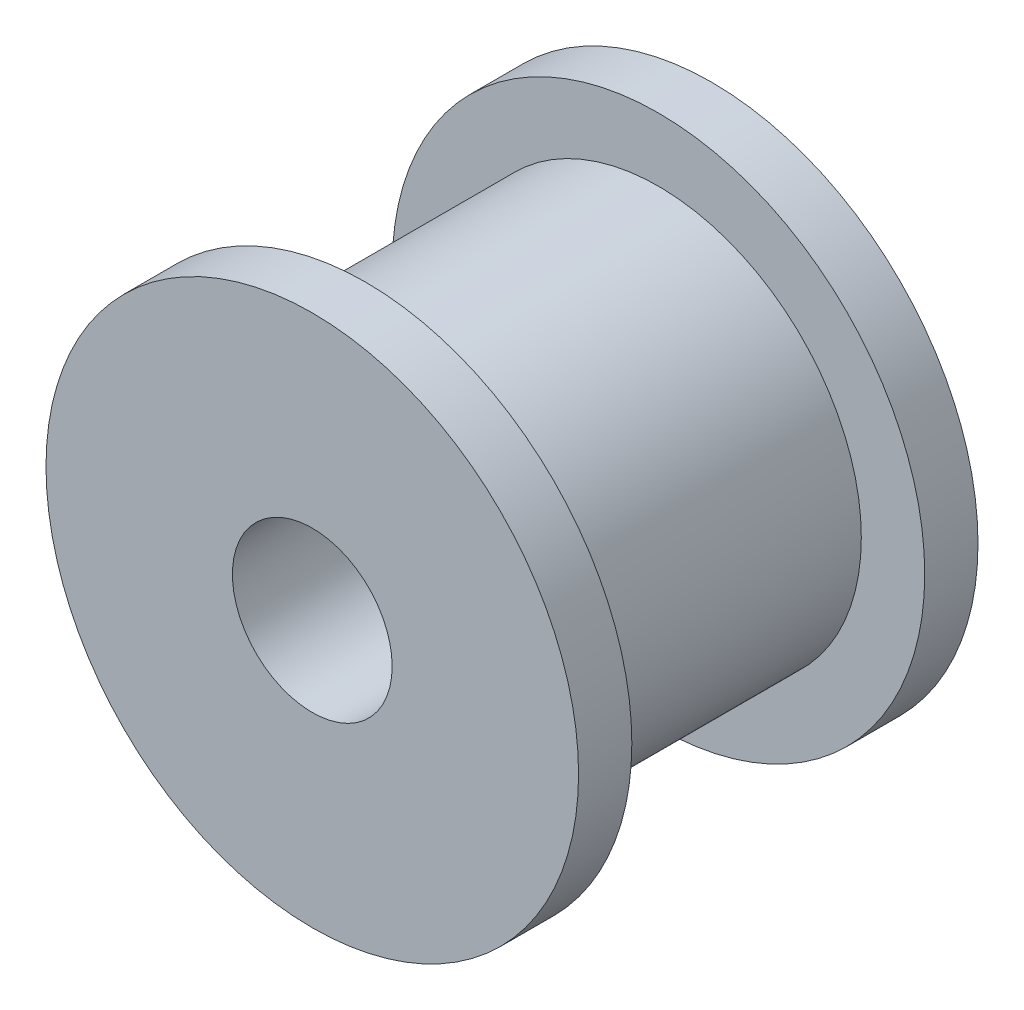
ISO-10303-21;
HEADER;
FILE_DESCRIPTION(('STEP AP214'),'2;1');
FILE_NAME('part.step','',(''),(''),'','','');
FILE_SCHEMA(('AUTOMOTIVE_DESIGN { 1 0 10303 214 1 1 1 1 }'));
ENDSEC;
DATA;
#1=APPLICATION_CONTEXT('core data for automotive mechanical design processes');
#2=APPLICATION_PROTOCOL_DEFINITION('international standard','automotive_design',2000,#1);
#3=PRODUCT_CONTEXT('',#1,'mechanical');
#4=PRODUCT('Part','Part','',(#3));
#5=PRODUCT_RELATED_PRODUCT_CATEGORY('part','',(#4));
#6=PRODUCT_DEFINITION_FORMATION('','',#4);
#7=PRODUCT_DEFINITION_CONTEXT('part definition',#1,'design');
#8=PRODUCT_DEFINITION('design','',#6,#7);
#9=PRODUCT_DEFINITION_SHAPE('','',#8);
#10=(LENGTH_UNIT() NAMED_UNIT(*) SI_UNIT(.MILLI.,.METRE.));
#11=(NAMED_UNIT(*) PLANE_ANGLE_UNIT() SI_UNIT($,.RADIAN.));
#12=(NAMED_UNIT(*) SI_UNIT($,.STERADIAN.) SOLID_ANGLE_UNIT());
#13=UNCERTAINTY_MEASURE_WITH_UNIT(LENGTH_MEASURE(1.E-05),#10,'distance_accuracy_value','');
#14=(GEOMETRIC_REPRESENTATION_CONTEXT(3) GLOBAL_UNCERTAINTY_ASSIGNED_CONTEXT((#13)) GLOBAL_UNIT_ASSIGNED_CONTEXT((#10,
#11,#12)) REPRESENTATION_CONTEXT('',''));
#15=CARTESIAN_POINT('',(0.,0.,0.));
#16=DIRECTION('',(0.,0.,1.));
#17=DIRECTION('',(1.,0.,0.));
#18=AXIS2_PLACEMENT_3D('',#15,#16,#17);
#19=CARTESIAN_POINT('',(0.,0.,15.));
#20=DIRECTION('',(0.,0.,-1.));
#21=DIRECTION('',(-1.,0.,0.));
#22=AXIS2_PLACEMENT_3D('',#19,#20,#21);
#23=CYLINDRICAL_SURFACE('',#22,10.);
#24=CARTESIAN_POINT('',(0.,0.,0.));
#25=DIRECTION('',(0.,0.,1.));
#26=DIRECTION('',(1.,0.,0.));
#27=AXIS2_PLACEMENT_3D('',#24,#25,#26);
#28=CIRCLE('',#27,10.);
#29=CARTESIAN_POINT('',(10.,0.,0.));
#30=VERTEX_POINT('',#29);
#31=EDGE_CURVE('E48',#30,#30,#28,.T.);
#32=ORIENTED_EDGE('',*,*,#31,.T.);
#33=EDGE_LOOP('',(#32));
#34=FACE_BOUND('',#33,.T.);
#35=CARTESIAN_POINT('',(0.,0.,2.));
#36=DIRECTION('',(0.,0.,1.));
#37=DIRECTION('',(1.,0.,0.));
#38=AXIS2_PLACEMENT_3D('',#35,#36,#37);
#39=CIRCLE('',#38,10.);
#40=CARTESIAN_POINT('',(10.,0.,2.));
#41=VERTEX_POINT('',#40);
#42=EDGE_CURVE('E59',#41,#41,#39,.T.);
#43=ORIENTED_EDGE('',*,*,#42,.F.);
#44=EDGE_LOOP('',(#43));
#45=FACE_BOUND('',#44,.T.);
#46=ADVANCED_FACE('F39',(#34,#45),#23,.T.);
#47=CARTESIAN_POINT('',(0.,0.,15.));
#48=DIRECTION('',(0.,0.,1.));
#49=DIRECTION('',(1.,0.,0.));
#50=AXIS2_PLACEMENT_3D('',#47,#48,#49);
#51=PLANE('',#50);
#52=CARTESIAN_POINT('',(0.,0.,15.));
#53=DIRECTION('',(0.,0.,1.));
#54=DIRECTION('',(1.,0.,0.));
#55=AXIS2_PLACEMENT_3D('',#52,#53,#54);
#56=CIRCLE('',#55,10.);
#57=CARTESIAN_POINT('',(10.,0.,15.));
#58=VERTEX_POINT('',#57);
#59=EDGE_CURVE('E11',#58,#58,#56,.T.);
#60=ORIENTED_EDGE('',*,*,#59,.T.);
#61=EDGE_LOOP('',(#60));
#62=FACE_BOUND('',#61,.T.);
#63=CARTESIAN_POINT('',(0.,0.,15.));
#64=DIRECTION('',(0.,0.,1.));
#65=DIRECTION('',(1.,0.,0.));
#66=AXIS2_PLACEMENT_3D('',#63,#64,#65);
#67=CIRCLE('',#66,3.);
#68=CARTESIAN_POINT('',(3.,0.,15.));
#69=VERTEX_POINT('',#68);
#70=EDGE_CURVE('E54',#69,#69,#67,.T.);
#71=ORIENTED_EDGE('',*,*,#70,.F.);
#72=EDGE_LOOP('',(#71));
#73=FACE_BOUND('',#72,.T.);
#74=ADVANCED_FACE('F100',(#62,#73),#51,.T.);
#75=CARTESIAN_POINT('',(0.,0.,0.));
#76=DIRECTION('',(0.,0.,1.));
#77=DIRECTION('',(1.,0.,0.));
#78=AXIS2_PLACEMENT_3D('',#75,#76,#77);
#79=PLANE('',#78);
#80=ORIENTED_EDGE('',*,*,#31,.F.);
#81=EDGE_LOOP('',(#80));
#82=FACE_BOUND('',#81,.T.);
#83=CARTESIAN_POINT('',(0.,0.,0.));
#84=DIRECTION('',(0.,0.,1.));
#85=DIRECTION('',(1.,0.,0.));
#86=AXIS2_PLACEMENT_3D('',#83,#84,#85);
#87=CIRCLE('',#86,3.);
#88=CARTESIAN_POINT('',(3.,0.,0.));
#89=VERTEX_POINT('',#88);
#90=EDGE_CURVE('E57',#89,#89,#87,.T.);
#91=ORIENTED_EDGE('',*,*,#90,.T.);
#92=EDGE_LOOP('',(#91));
#93=FACE_BOUND('',#92,.T.);
#94=ADVANCED_FACE('F84',(#82,#93),#79,.F.);
#95=CARTESIAN_POINT('',(0.,0.,13.));
#96=DIRECTION('',(0.,0.,1.));
#97=DIRECTION('',(1.,0.,0.));
#98=AXIS2_PLACEMENT_3D('',#95,#96,#97);
#99=CIRCLE('',#98,10.);
#100=CARTESIAN_POINT('',(10.,0.,13.));
#101=VERTEX_POINT('',#100);
#102=EDGE_CURVE('E43',#101,#101,#99,.T.);
#103=ORIENTED_EDGE('',*,*,#102,.T.);
#104=EDGE_LOOP('',(#103));
#105=FACE_BOUND('',#104,.T.);
#106=ORIENTED_EDGE('',*,*,#59,.F.);
#107=EDGE_LOOP('',(#106));
#108=FACE_BOUND('',#107,.T.);
#109=ADVANCED_FACE('F41',(#105,#108),#23,.T.);
#110=CARTESIAN_POINT('',(0.,0.,15.));
#111=DIRECTION('',(0.,0.,-1.));
#112=DIRECTION('',(-1.,0.,0.));
#113=AXIS2_PLACEMENT_3D('',#110,#111,#112);
#114=CYLINDRICAL_SURFACE('',#113,3.);
#115=ORIENTED_EDGE('',*,*,#70,.T.);
#116=EDGE_LOOP('',(#115));
#117=FACE_BOUND('',#116,.T.);
#118=ORIENTED_EDGE('',*,*,#90,.F.);
#119=EDGE_LOOP('',(#118));
#120=FACE_BOUND('',#119,.T.);
#121=ADVANCED_FACE('F86',(#117,#120),#114,.F.);
#122=CARTESIAN_POINT('',(0.,0.,13.));
#123=DIRECTION('',(0.,0.,1.));
#124=DIRECTION('',(1.,0.,0.));
#125=AXIS2_PLACEMENT_3D('',#122,#123,#124);
#126=PLANE('',#125);
#127=CARTESIAN_POINT('',(0.,0.,13.));
#128=DIRECTION('',(0.,0.,1.));
#129=DIRECTION('',(1.,0.,0.));
#130=AXIS2_PLACEMENT_3D('',#127,#128,#129);
#131=CIRCLE('',#130,7.61841917315148);
#132=CARTESIAN_POINT('',(7.61841917315148,0.,13.));
#133=VERTEX_POINT('',#132);
#134=EDGE_CURVE('E69',#133,#133,#131,.T.);
#135=ORIENTED_EDGE('',*,*,#134,.T.);
#136=EDGE_LOOP('',(#135));
#137=FACE_BOUND('',#136,.T.);
#138=ORIENTED_EDGE('',*,*,#102,.F.);
#139=EDGE_LOOP('',(#138));
#140=FACE_BOUND('',#139,.T.);
#141=ADVANCED_FACE('F88',(#137,#140),#126,.F.);
#142=CARTESIAN_POINT('',(0.,0.,2.));
#143=DIRECTION('',(0.,0.,1.));
#144=DIRECTION('',(1.,0.,0.));
#145=AXIS2_PLACEMENT_3D('',#142,#143,#144);
#146=PLANE('',#145);
#147=CARTESIAN_POINT('',(0.,0.,2.));
#148=DIRECTION('',(0.,0.,1.));
#149=DIRECTION('',(1.,0.,0.));
#150=AXIS2_PLACEMENT_3D('',#147,#148,#149);
#151=CIRCLE('',#150,7.61841917315148);
#152=CARTESIAN_POINT('',(7.61841917315148,0.,2.));
#153=VERTEX_POINT('',#152);
#154=EDGE_CURVE('E62',#153,#153,#151,.F.);
#155=ORIENTED_EDGE('',*,*,#154,.T.);
#156=EDGE_LOOP('',(#155));
#157=FACE_BOUND('',#156,.T.);
#158=ORIENTED_EDGE('',*,*,#42,.T.);
#159=EDGE_LOOP('',(#158));
#160=FACE_BOUND('',#159,.T.);
#161=ADVANCED_FACE('F94',(#157,#160),#146,.T.);
#162=CARTESIAN_POINT('',(0.,0.,-28.293522060618));
#163=DIRECTION('',(0.,0.,1.));
#164=DIRECTION('',(1.,0.,0.));
#165=AXIS2_PLACEMENT_3D('',#162,#163,#164);
#166=CYLINDRICAL_SURFACE('',#165,7.61841917315148);
#167=ORIENTED_EDGE('',*,*,#154,.F.);
#168=EDGE_LOOP('',(#167));
#169=FACE_BOUND('',#168,.T.);
#170=ORIENTED_EDGE('',*,*,#134,.F.);
#171=EDGE_LOOP('',(#170));
#172=FACE_BOUND('',#171,.T.);
#173=ADVANCED_FACE('F135',(#169,#172),#166,.T.);
#174=CLOSED_SHELL('',(#46,#74,#94,#109,#121,#141,#161,#173));
#175=MANIFOLD_SOLID_BREP('B2',#174);
#176=ADVANCED_BREP_SHAPE_REPRESENTATION('',(#18,#175),#14);
#177=SHAPE_DEFINITION_REPRESENTATION(#9,#176);
ENDSEC;
END-ISO-10303-21;
